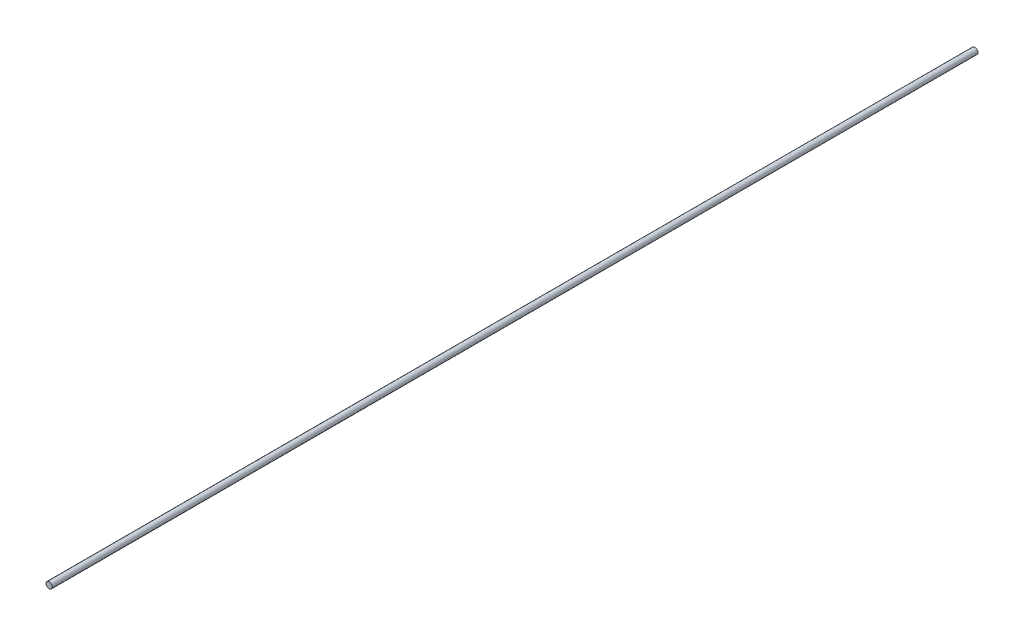
ISO-10303-21;
HEADER;
FILE_DESCRIPTION(('STEP AP214'),'2;1');
FILE_NAME('part.step','',(''),(''),'','','');
FILE_SCHEMA(('AUTOMOTIVE_DESIGN { 1 0 10303 214 1 1 1 1 }'));
ENDSEC;
DATA;
#1=APPLICATION_CONTEXT('core data for automotive mechanical design processes');
#2=APPLICATION_PROTOCOL_DEFINITION('international standard','automotive_design',2000,#1);
#3=PRODUCT_CONTEXT('',#1,'mechanical');
#4=PRODUCT('Part','Part','',(#3));
#5=PRODUCT_RELATED_PRODUCT_CATEGORY('part','',(#4));
#6=PRODUCT_DEFINITION_FORMATION('','',#4);
#7=PRODUCT_DEFINITION_CONTEXT('part definition',#1,'design');
#8=PRODUCT_DEFINITION('design','',#6,#7);
#9=PRODUCT_DEFINITION_SHAPE('','',#8);
#10=(LENGTH_UNIT() NAMED_UNIT(*) SI_UNIT(.MILLI.,.METRE.));
#11=(NAMED_UNIT(*) PLANE_ANGLE_UNIT() SI_UNIT($,.RADIAN.));
#12=(NAMED_UNIT(*) SI_UNIT($,.STERADIAN.) SOLID_ANGLE_UNIT());
#13=UNCERTAINTY_MEASURE_WITH_UNIT(LENGTH_MEASURE(1.E-05),#10,'distance_accuracy_value','');
#14=(GEOMETRIC_REPRESENTATION_CONTEXT(3) GLOBAL_UNCERTAINTY_ASSIGNED_CONTEXT((#13)) GLOBAL_UNIT_ASSIGNED_CONTEXT((#10,
#11,#12)) REPRESENTATION_CONTEXT('',''));
#15=CARTESIAN_POINT('',(0.,0.,0.));
#16=DIRECTION('',(0.,0.,1.));
#17=DIRECTION('',(1.,0.,0.));
#18=AXIS2_PLACEMENT_3D('',#15,#16,#17);
#19=CARTESIAN_POINT('',(0.,0.,600.));
#20=DIRECTION('',(0.,0.,-1.));
#21=DIRECTION('',(-1.,0.,0.));
#22=AXIS2_PLACEMENT_3D('',#19,#20,#21);
#23=CYLINDRICAL_SURFACE('',#22,2.);
#24=CARTESIAN_POINT('',(0.,0.,600.));
#25=DIRECTION('',(0.,0.,1.));
#26=DIRECTION('',(1.,0.,0.));
#27=AXIS2_PLACEMENT_3D('',#24,#25,#26);
#28=CIRCLE('',#27,2.);
#29=CARTESIAN_POINT('',(2.,0.,600.));
#30=VERTEX_POINT('',#29);
#31=EDGE_CURVE('E10',#30,#30,#28,.T.);
#32=ORIENTED_EDGE('',*,*,#31,.F.);
#33=EDGE_LOOP('',(#32));
#34=FACE_BOUND('',#33,.T.);
#35=CARTESIAN_POINT('',(0.,0.,0.));
#36=DIRECTION('',(0.,0.,1.));
#37=DIRECTION('',(1.,0.,0.));
#38=AXIS2_PLACEMENT_3D('',#35,#36,#37);
#39=CIRCLE('',#38,2.);
#40=CARTESIAN_POINT('',(2.,0.,0.));
#41=VERTEX_POINT('',#40);
#42=EDGE_CURVE('E34',#41,#41,#39,.T.);
#43=ORIENTED_EDGE('',*,*,#42,.T.);
#44=EDGE_LOOP('',(#43));
#45=FACE_BOUND('',#44,.T.);
#46=ADVANCED_FACE('F31',(#34,#45),#23,.T.);
#47=CARTESIAN_POINT('',(0.,0.,600.));
#48=DIRECTION('',(0.,0.,1.));
#49=DIRECTION('',(1.,0.,0.));
#50=AXIS2_PLACEMENT_3D('',#47,#48,#49);
#51=PLANE('',#50);
#52=ORIENTED_EDGE('',*,*,#31,.T.);
#53=EDGE_LOOP('',(#52));
#54=FACE_BOUND('',#53,.T.);
#55=ADVANCED_FACE('F46',(#54),#51,.T.);
#56=CARTESIAN_POINT('',(0.,0.,0.));
#57=DIRECTION('',(0.,0.,1.));
#58=DIRECTION('',(1.,0.,0.));
#59=AXIS2_PLACEMENT_3D('',#56,#57,#58);
#60=PLANE('',#59);
#61=ORIENTED_EDGE('',*,*,#42,.F.);
#62=EDGE_LOOP('',(#61));
#63=FACE_BOUND('',#62,.T.);
#64=ADVANCED_FACE('F44',(#63),#60,.F.);
#65=CLOSED_SHELL('',(#46,#55,#64));
#66=MANIFOLD_SOLID_BREP('B2',#65);
#67=ADVANCED_BREP_SHAPE_REPRESENTATION('',(#18,#66),#14);
#68=SHAPE_DEFINITION_REPRESENTATION(#9,#67);
ENDSEC;
END-ISO-10303-21;
